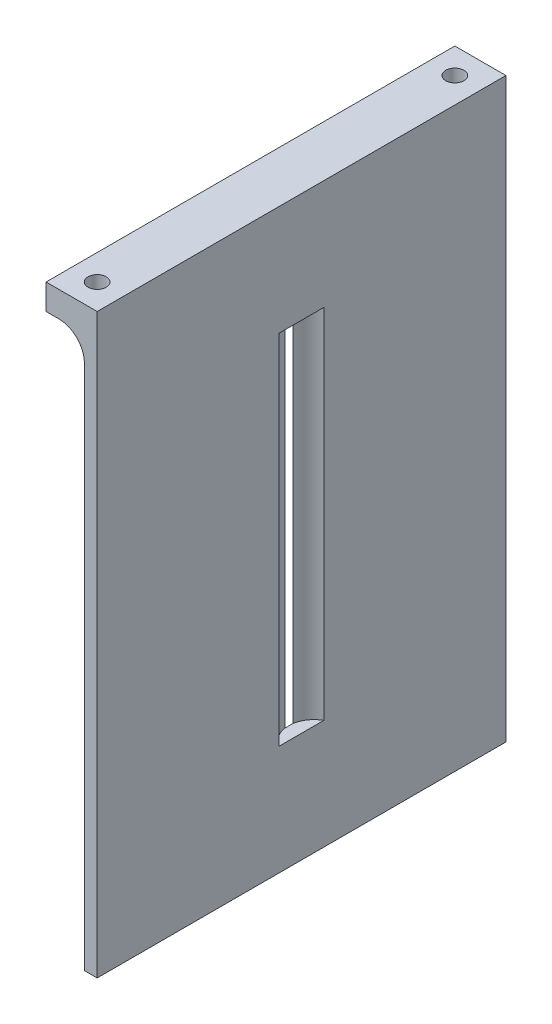
ISO-10303-21;
HEADER;
FILE_DESCRIPTION(('STEP AP214'),'2;1');
FILE_NAME('part.step','',(''),(''),'','','');
FILE_SCHEMA(('AUTOMOTIVE_DESIGN { 1 0 10303 214 1 1 1 1 }'));
ENDSEC;
DATA;
#1=APPLICATION_CONTEXT('core data for automotive mechanical design processes');
#2=APPLICATION_PROTOCOL_DEFINITION('international standard','automotive_design',2000,#1);
#3=PRODUCT_CONTEXT('',#1,'mechanical');
#4=PRODUCT('Part','Part','',(#3));
#5=PRODUCT_RELATED_PRODUCT_CATEGORY('part','',(#4));
#6=PRODUCT_DEFINITION_FORMATION('','',#4);
#7=PRODUCT_DEFINITION_CONTEXT('part definition',#1,'design');
#8=PRODUCT_DEFINITION('design','',#6,#7);
#9=PRODUCT_DEFINITION_SHAPE('','',#8);
#10=(LENGTH_UNIT() NAMED_UNIT(*) SI_UNIT(.MILLI.,.METRE.));
#11=(NAMED_UNIT(*) PLANE_ANGLE_UNIT() SI_UNIT($,.RADIAN.));
#12=(NAMED_UNIT(*) SI_UNIT($,.STERADIAN.) SOLID_ANGLE_UNIT());
#13=UNCERTAINTY_MEASURE_WITH_UNIT(LENGTH_MEASURE(1.E-05),#10,'distance_accuracy_value','');
#14=(GEOMETRIC_REPRESENTATION_CONTEXT(3) GLOBAL_UNCERTAINTY_ASSIGNED_CONTEXT((#13)) GLOBAL_UNIT_ASSIGNED_CONTEXT((#10,
#11,#12)) REPRESENTATION_CONTEXT('',''));
#15=CARTESIAN_POINT('',(0.,0.,0.));
#16=DIRECTION('',(0.,0.,1.));
#17=DIRECTION('',(1.,0.,0.));
#18=AXIS2_PLACEMENT_3D('',#15,#16,#17);
#19=CARTESIAN_POINT('',(52.8754332999628,0.,0.));
#20=DIRECTION('',(-1.,0.,0.));
#21=DIRECTION('',(0.,0.,1.));
#22=AXIS2_PLACEMENT_3D('',#19,#20,#21);
#23=PLANE('',#22);
#24=DIRECTION('',(0.,0.,-1.));
#25=VECTOR('',#24,1.);
#26=CARTESIAN_POINT('',(52.8754332999628,35.86734,-25.4));
#27=LINE('',#26,#25);
#28=CARTESIAN_POINT('',(52.8754332999628,35.86734,25.4));
#29=VERTEX_POINT('',#28);
#30=CARTESIAN_POINT('',(52.8754332999628,35.86734,-25.4));
#31=VERTEX_POINT('',#30);
#32=EDGE_CURVE('E191',#29,#31,#27,.T.);
#33=ORIENTED_EDGE('',*,*,#32,.F.);
#34=DIRECTION('',(0.,1.,0.));
#35=VECTOR('',#34,1.);
#36=CARTESIAN_POINT('',(52.8754332999628,35.86734,25.4));
#37=LINE('',#36,#35);
#38=CARTESIAN_POINT('',(52.8754332999628,-35.86734,25.4));
#39=VERTEX_POINT('',#38);
#40=EDGE_CURVE('E200',#39,#29,#37,.T.);
#41=ORIENTED_EDGE('',*,*,#40,.F.);
#42=DIRECTION('',(0.,0.,1.));
#43=VECTOR('',#42,1.);
#44=CARTESIAN_POINT('',(52.8754332999628,-35.86734,-25.4));
#45=LINE('',#44,#43);
#46=CARTESIAN_POINT('',(52.8754332999628,-35.86734,-25.4));
#47=VERTEX_POINT('',#46);
#48=EDGE_CURVE('E198',#47,#39,#45,.T.);
#49=ORIENTED_EDGE('',*,*,#48,.F.);
#50=DIRECTION('',(0.,-1.,0.));
#51=VECTOR('',#50,1.);
#52=CARTESIAN_POINT('',(52.8754332999628,35.86734,-25.4));
#53=LINE('',#52,#51);
#54=EDGE_CURVE('E185',#31,#47,#53,.T.);
#55=ORIENTED_EDGE('',*,*,#54,.F.);
#56=EDGE_LOOP('',(#33,#41,#49,#55));
#57=FACE_BOUND('',#56,.T.);
#58=DIRECTION('',(0.,1.,0.));
#59=VECTOR('',#58,1.);
#60=CARTESIAN_POINT('',(52.8754332999628,-31.2052561210692,2.77170963560014));
#61=LINE('',#60,#59);
#62=CARTESIAN_POINT('',(52.8754332999628,22.225,2.77170963560014));
#63=VERTEX_POINT('',#62);
#64=CARTESIAN_POINT('',(52.8754332999628,-22.225,2.77170963560014));
#65=VERTEX_POINT('',#64);
#66=EDGE_CURVE('E153',#63,#65,#61,.F.);
#67=ORIENTED_EDGE('',*,*,#66,.F.);
#68=DIRECTION('',(0.,0.,-1.));
#69=VECTOR('',#68,1.);
#70=CARTESIAN_POINT('',(52.8754332999628,22.225,-0.495299999999999));
#71=LINE('',#70,#69);
#72=CARTESIAN_POINT('',(52.8754332999628,22.225,-2.77170963560013));
#73=VERTEX_POINT('',#72);
#74=EDGE_CURVE('E141',#63,#73,#71,.T.);
#75=ORIENTED_EDGE('',*,*,#74,.T.);
#76=DIRECTION('',(0.,1.,0.));
#77=VECTOR('',#76,1.);
#78=CARTESIAN_POINT('',(52.8754332999628,-31.2052561210692,-2.77170963560013));
#79=LINE('',#78,#77);
#80=CARTESIAN_POINT('',(52.8754332999628,-22.225,-2.77170963560013));
#81=VERTEX_POINT('',#80);
#82=EDGE_CURVE('E147',#81,#73,#79,.T.);
#83=ORIENTED_EDGE('',*,*,#82,.F.);
#84=DIRECTION('',(0.,0.,1.));
#85=VECTOR('',#84,1.);
#86=CARTESIAN_POINT('',(52.8754332999628,-22.225,-0.495299999999999));
#87=LINE('',#86,#85);
#88=EDGE_CURVE('E130',#81,#65,#87,.T.);
#89=ORIENTED_EDGE('',*,*,#88,.T.);
#90=EDGE_LOOP('',(#67,#75,#83,#89));
#91=FACE_BOUND('',#90,.T.);
#92=ADVANCED_FACE('F41',(#57,#91),#23,.F.);
#93=CARTESIAN_POINT('',(51.2879332999628,0.,0.));
#94=DIRECTION('',(-1.,0.,0.));
#95=DIRECTION('',(0.,0.,1.));
#96=AXIS2_PLACEMENT_3D('',#93,#94,#95);
#97=PLANE('',#96);
#98=DIRECTION('',(0.,0.,1.));
#99=VECTOR('',#98,1.);
#100=CARTESIAN_POINT('',(51.2879332999628,-22.225,-0.495299999999999));
#101=LINE('',#100,#99);
#102=CARTESIAN_POINT('',(51.2879332999628,-22.225,-0.495299999999999));
#103=VERTEX_POINT('',#102);
#104=CARTESIAN_POINT('',(51.2879332999628,-22.225,0.495300000000001));
#105=VERTEX_POINT('',#104);
#106=EDGE_CURVE('E179',#103,#105,#101,.T.);
#107=ORIENTED_EDGE('',*,*,#106,.F.);
#108=DIRECTION('',(0.,-1.,0.));
#109=VECTOR('',#108,1.);
#110=CARTESIAN_POINT('',(51.2879332999628,22.225,-0.495299999999999));
#111=LINE('',#110,#109);
#112=CARTESIAN_POINT('',(51.2879332999628,22.225,-0.495299999999997));
#113=VERTEX_POINT('',#112);
#114=EDGE_CURVE('E150',#113,#103,#111,.T.);
#115=ORIENTED_EDGE('',*,*,#114,.F.);
#116=DIRECTION('',(0.,0.,-1.));
#117=VECTOR('',#116,1.);
#118=CARTESIAN_POINT('',(51.2879332999628,22.225,-0.495299999999999));
#119=LINE('',#118,#117);
#120=CARTESIAN_POINT('',(51.2879332999628,22.225,0.495300000000028));
#121=VERTEX_POINT('',#120);
#122=EDGE_CURVE('E183',#121,#113,#119,.T.);
#123=ORIENTED_EDGE('',*,*,#122,.F.);
#124=DIRECTION('',(0.,1.,0.));
#125=VECTOR('',#124,1.);
#126=CARTESIAN_POINT('',(51.2879332999628,22.225,0.495300000000001));
#127=LINE('',#126,#125);
#128=EDGE_CURVE('E181',#105,#121,#127,.T.);
#129=ORIENTED_EDGE('',*,*,#128,.F.);
#130=EDGE_LOOP('',(#107,#115,#123,#129));
#131=FACE_BOUND('',#130,.T.);
#132=DIRECTION('',(0.,1.,0.));
#133=VECTOR('',#132,1.);
#134=CARTESIAN_POINT('',(51.2879332999628,35.86734,25.4));
#135=LINE('',#134,#133);
#136=CARTESIAN_POINT('',(51.2879332999628,-35.86734,25.4));
#137=VERTEX_POINT('',#136);
#138=CARTESIAN_POINT('',(51.2879332999628,29.51734,25.4));
#139=VERTEX_POINT('',#138);
#140=EDGE_CURVE('E193',#137,#139,#135,.T.);
#141=ORIENTED_EDGE('',*,*,#140,.T.);
#142=DIRECTION('',(0.,0.,-1.));
#143=VECTOR('',#142,1.);
#144=CARTESIAN_POINT('',(51.2879332999628,29.51734,0.));
#145=LINE('',#144,#143);
#146=CARTESIAN_POINT('',(51.2879332999628,29.51734,-25.4));
#147=VERTEX_POINT('',#146);
#148=EDGE_CURVE('E214',#139,#147,#145,.T.);
#149=ORIENTED_EDGE('',*,*,#148,.T.);
#150=DIRECTION('',(0.,-1.,0.));
#151=VECTOR('',#150,1.);
#152=CARTESIAN_POINT('',(51.2879332999628,35.86734,-25.4));
#153=LINE('',#152,#151);
#154=CARTESIAN_POINT('',(51.2879332999628,-35.86734,-25.4));
#155=VERTEX_POINT('',#154);
#156=EDGE_CURVE('E188',#147,#155,#153,.T.);
#157=ORIENTED_EDGE('',*,*,#156,.T.);
#158=DIRECTION('',(0.,0.,1.));
#159=VECTOR('',#158,1.);
#160=CARTESIAN_POINT('',(51.2879332999628,-35.86734,-25.4));
#161=LINE('',#160,#159);
#162=EDGE_CURVE('E190',#155,#137,#161,.T.);
#163=ORIENTED_EDGE('',*,*,#162,.T.);
#164=EDGE_LOOP('',(#141,#149,#157,#163));
#165=FACE_BOUND('',#164,.T.);
#166=ADVANCED_FACE('F245',(#131,#165),#97,.T.);
#167=CARTESIAN_POINT('',(51.2879332999628,35.86734,-25.4));
#168=DIRECTION('',(0.,0.,1.));
#169=DIRECTION('',(1.,0.,0.));
#170=AXIS2_PLACEMENT_3D('',#167,#168,#169);
#171=PLANE('',#170);
#172=ORIENTED_EDGE('',*,*,#54,.T.);
#173=DIRECTION('',(1.,0.,0.));
#174=VECTOR('',#173,1.);
#175=CARTESIAN_POINT('',(51.2879332999628,-35.86734,-25.4));
#176=LINE('',#175,#174);
#177=EDGE_CURVE('E211',#155,#47,#176,.T.);
#178=ORIENTED_EDGE('',*,*,#177,.F.);
#179=ORIENTED_EDGE('',*,*,#156,.F.);
#180=CARTESIAN_POINT('',(48.1129332999628,29.51734,-25.4));
#181=DIRECTION('',(0.,0.,1.));
#182=DIRECTION('',(1.,0.,0.));
#183=AXIS2_PLACEMENT_3D('',#180,#181,#182);
#184=CIRCLE('',#183,3.175);
#185=CARTESIAN_POINT('',(48.1129332999628,32.69234,-25.4));
#186=VERTEX_POINT('',#185);
#187=EDGE_CURVE('E55',#147,#186,#184,.T.);
#188=ORIENTED_EDGE('',*,*,#187,.T.);
#189=DIRECTION('',(1.,0.,0.));
#190=VECTOR('',#189,1.);
#191=CARTESIAN_POINT('',(46.5254332999628,32.69234,-25.4));
#192=LINE('',#191,#190);
#193=CARTESIAN_POINT('',(46.5254332999628,32.69234,-25.4));
#194=VERTEX_POINT('',#193);
#195=EDGE_CURVE('E142',#194,#186,#192,.T.);
#196=ORIENTED_EDGE('',*,*,#195,.F.);
#197=DIRECTION('',(0.,-1.,0.));
#198=VECTOR('',#197,1.);
#199=CARTESIAN_POINT('',(46.5254332999628,35.86734,-25.4));
#200=LINE('',#199,#198);
#201=CARTESIAN_POINT('',(46.5254332999628,35.86734,-25.4));
#202=VERTEX_POINT('',#201);
#203=EDGE_CURVE('E168',#202,#194,#200,.T.);
#204=ORIENTED_EDGE('',*,*,#203,.F.);
#205=DIRECTION('',(1.,0.,0.));
#206=VECTOR('',#205,1.);
#207=CARTESIAN_POINT('',(51.2879332999628,35.86734,-25.4));
#208=LINE('',#207,#206);
#209=EDGE_CURVE('E196',#202,#31,#208,.T.);
#210=ORIENTED_EDGE('',*,*,#209,.T.);
#211=EDGE_LOOP('',(#172,#178,#179,#188,#196,#204,#210));
#212=FACE_BOUND('',#211,.T.);
#213=ADVANCED_FACE('F248',(#212),#171,.F.);
#214=CARTESIAN_POINT('',(51.2879332999628,-35.86734,-25.4));
#215=DIRECTION('',(0.,1.,0.));
#216=DIRECTION('',(0.,0.,1.));
#217=AXIS2_PLACEMENT_3D('',#214,#215,#216);
#218=PLANE('',#217);
#219=ORIENTED_EDGE('',*,*,#48,.T.);
#220=DIRECTION('',(1.,0.,0.));
#221=VECTOR('',#220,1.);
#222=CARTESIAN_POINT('',(51.2879332999628,-35.86734,25.4));
#223=LINE('',#222,#221);
#224=EDGE_CURVE('E208',#137,#39,#223,.T.);
#225=ORIENTED_EDGE('',*,*,#224,.F.);
#226=ORIENTED_EDGE('',*,*,#162,.F.);
#227=ORIENTED_EDGE('',*,*,#177,.T.);
#228=EDGE_LOOP('',(#219,#225,#226,#227));
#229=FACE_BOUND('',#228,.T.);
#230=ADVANCED_FACE('F259',(#229),#218,.F.);
#231=CARTESIAN_POINT('',(51.2879332999628,35.86734,25.4));
#232=DIRECTION('',(0.,0.,-1.));
#233=DIRECTION('',(-1.,0.,0.));
#234=AXIS2_PLACEMENT_3D('',#231,#232,#233);
#235=PLANE('',#234);
#236=DIRECTION('',(1.,0.,0.));
#237=VECTOR('',#236,1.);
#238=CARTESIAN_POINT('',(51.2879332999628,35.86734,25.4));
#239=LINE('',#238,#237);
#240=CARTESIAN_POINT('',(46.5254332999628,35.86734,25.4));
#241=VERTEX_POINT('',#240);
#242=EDGE_CURVE('E205',#241,#29,#239,.T.);
#243=ORIENTED_EDGE('',*,*,#242,.F.);
#244=DIRECTION('',(0.,1.,0.));
#245=VECTOR('',#244,1.);
#246=CARTESIAN_POINT('',(46.5254332999628,35.86734,25.4));
#247=LINE('',#246,#245);
#248=CARTESIAN_POINT('',(46.5254332999628,32.69234,25.4));
#249=VERTEX_POINT('',#248);
#250=EDGE_CURVE('E172',#249,#241,#247,.T.);
#251=ORIENTED_EDGE('',*,*,#250,.F.);
#252=DIRECTION('',(1.,0.,0.));
#253=VECTOR('',#252,1.);
#254=CARTESIAN_POINT('',(46.5254332999628,32.69234,25.4));
#255=LINE('',#254,#253);
#256=CARTESIAN_POINT('',(48.1129332999628,32.69234,25.4));
#257=VERTEX_POINT('',#256);
#258=EDGE_CURVE('E175',#249,#257,#255,.T.);
#259=ORIENTED_EDGE('',*,*,#258,.T.);
#260=CARTESIAN_POINT('',(48.1129332999628,29.51734,25.4));
#261=DIRECTION('',(0.,0.,-1.));
#262=DIRECTION('',(-1.,0.,0.));
#263=AXIS2_PLACEMENT_3D('',#260,#261,#262);
#264=CIRCLE('',#263,3.175);
#265=EDGE_CURVE('E11',#257,#139,#264,.T.);
#266=ORIENTED_EDGE('',*,*,#265,.T.);
#267=ORIENTED_EDGE('',*,*,#140,.F.);
#268=ORIENTED_EDGE('',*,*,#224,.T.);
#269=ORIENTED_EDGE('',*,*,#40,.T.);
#270=EDGE_LOOP('',(#243,#251,#259,#266,#267,#268,#269));
#271=FACE_BOUND('',#270,.T.);
#272=ADVANCED_FACE('F255',(#271),#235,.F.);
#273=CARTESIAN_POINT('',(51.2879332999628,35.86734,-25.4));
#274=DIRECTION('',(0.,-1.,0.));
#275=DIRECTION('',(0.,0.,-1.));
#276=AXIS2_PLACEMENT_3D('',#273,#274,#275);
#277=PLANE('',#276);
#278=CARTESIAN_POINT('',(49.7004332999628,35.86734,22.225));
#279=DIRECTION('',(0.,1.,0.));
#280=DIRECTION('',(0.,0.,1.));
#281=AXIS2_PLACEMENT_3D('',#278,#279,#280);
#282=CIRCLE('',#281,1.13029999999999);
#283=CARTESIAN_POINT('',(49.7004332999628,35.86734,23.3553));
#284=VERTEX_POINT('',#283);
#285=EDGE_CURVE('E155',#284,#284,#282,.T.);
#286=ORIENTED_EDGE('',*,*,#285,.F.);
#287=EDGE_LOOP('',(#286));
#288=FACE_BOUND('',#287,.T.);
#289=CARTESIAN_POINT('',(49.7004332999628,35.86734,-22.225));
#290=DIRECTION('',(0.,1.,0.));
#291=DIRECTION('',(0.,0.,1.));
#292=AXIS2_PLACEMENT_3D('',#289,#290,#291);
#293=CIRCLE('',#292,1.13029999999999);
#294=CARTESIAN_POINT('',(49.7004332999628,35.86734,-21.0947));
#295=VERTEX_POINT('',#294);
#296=EDGE_CURVE('E161',#295,#295,#293,.T.);
#297=ORIENTED_EDGE('',*,*,#296,.F.);
#298=EDGE_LOOP('',(#297));
#299=FACE_BOUND('',#298,.T.);
#300=ORIENTED_EDGE('',*,*,#32,.T.);
#301=ORIENTED_EDGE('',*,*,#209,.F.);
#302=DIRECTION('',(0.,0.,-1.));
#303=VECTOR('',#302,1.);
#304=CARTESIAN_POINT('',(46.5254332999628,35.86734,-25.4));
#305=LINE('',#304,#303);
#306=EDGE_CURVE('E165',#241,#202,#305,.T.);
#307=ORIENTED_EDGE('',*,*,#306,.F.);
#308=ORIENTED_EDGE('',*,*,#242,.T.);
#309=EDGE_LOOP('',(#300,#301,#307,#308));
#310=FACE_BOUND('',#309,.T.);
#311=ADVANCED_FACE('F244',(#288,#299,#310),#277,.F.);
#312=CARTESIAN_POINT('',(51.2879332999628,-22.225,-0.495299999999999));
#313=DIRECTION('',(0.,1.,0.));
#314=DIRECTION('',(0.,0.,1.));
#315=AXIS2_PLACEMENT_3D('',#312,#313,#314);
#316=PLANE('',#315);
#317=ORIENTED_EDGE('',*,*,#88,.F.);
#318=CARTESIAN_POINT('',(54.4240619500663,-22.225,0.));
#319=DIRECTION('',(0.,1.,0.));
#320=DIRECTION('',(0.,0.,1.));
#321=AXIS2_PLACEMENT_3D('',#318,#319,#320);
#322=CIRCLE('',#321,3.17500000000001);
#323=EDGE_CURVE('E134',#81,#103,#322,.T.);
#324=ORIENTED_EDGE('',*,*,#323,.T.);
#325=ORIENTED_EDGE('',*,*,#106,.T.);
#326=EDGE_CURVE('E136',#105,#65,#322,.T.);
#327=ORIENTED_EDGE('',*,*,#326,.T.);
#328=EDGE_LOOP('',(#317,#324,#325,#327));
#329=FACE_BOUND('',#328,.T.);
#330=ADVANCED_FACE('F132',(#329),#316,.T.);
#331=CARTESIAN_POINT('',(51.2879332999628,22.225,-0.495299999999999));
#332=DIRECTION('',(0.,-1.,0.));
#333=DIRECTION('',(0.,0.,-1.));
#334=AXIS2_PLACEMENT_3D('',#331,#332,#333);
#335=PLANE('',#334);
#336=ORIENTED_EDGE('',*,*,#74,.F.);
#337=CARTESIAN_POINT('',(54.4240619500663,22.225,0.));
#338=DIRECTION('',(0.,-1.,0.));
#339=DIRECTION('',(0.,0.,-1.));
#340=AXIS2_PLACEMENT_3D('',#337,#338,#339);
#341=CIRCLE('',#340,3.17500000000001);
#342=EDGE_CURVE('E308',#63,#121,#341,.T.);
#343=ORIENTED_EDGE('',*,*,#342,.T.);
#344=ORIENTED_EDGE('',*,*,#122,.T.);
#345=EDGE_CURVE('E311',#113,#73,#341,.T.);
#346=ORIENTED_EDGE('',*,*,#345,.T.);
#347=EDGE_LOOP('',(#336,#343,#344,#346));
#348=FACE_BOUND('',#347,.T.);
#349=ADVANCED_FACE('F238',(#348),#335,.T.);
#350=CARTESIAN_POINT('',(46.5254332999628,32.69234,-25.4));
#351=DIRECTION('',(0.,1.,0.));
#352=DIRECTION('',(0.,0.,1.));
#353=AXIS2_PLACEMENT_3D('',#350,#351,#352);
#354=PLANE('',#353);
#355=ORIENTED_EDGE('',*,*,#195,.T.);
#356=DIRECTION('',(0.,0.,-1.));
#357=VECTOR('',#356,1.);
#358=CARTESIAN_POINT('',(48.1129332999628,32.69234,-25.4));
#359=LINE('',#358,#357);
#360=EDGE_CURVE('E69',#186,#257,#359,.F.);
#361=ORIENTED_EDGE('',*,*,#360,.T.);
#362=ORIENTED_EDGE('',*,*,#258,.F.);
#363=DIRECTION('',(0.,0.,1.));
#364=VECTOR('',#363,1.);
#365=CARTESIAN_POINT('',(46.5254332999628,32.69234,-25.4));
#366=LINE('',#365,#364);
#367=EDGE_CURVE('E170',#194,#249,#366,.T.);
#368=ORIENTED_EDGE('',*,*,#367,.F.);
#369=EDGE_LOOP('',(#355,#361,#362,#368));
#370=FACE_BOUND('',#369,.T.);
#371=ADVANCED_FACE('F234',(#370),#354,.F.);
#372=CARTESIAN_POINT('',(46.5254332999628,0.,0.));
#373=DIRECTION('',(1.,0.,0.));
#374=DIRECTION('',(0.,0.,-1.));
#375=AXIS2_PLACEMENT_3D('',#372,#373,#374);
#376=PLANE('',#375);
#377=ORIENTED_EDGE('',*,*,#306,.T.);
#378=ORIENTED_EDGE('',*,*,#203,.T.);
#379=ORIENTED_EDGE('',*,*,#367,.T.);
#380=ORIENTED_EDGE('',*,*,#250,.T.);
#381=EDGE_LOOP('',(#377,#378,#379,#380));
#382=FACE_BOUND('',#381,.T.);
#383=ADVANCED_FACE('F231',(#382),#376,.F.);
#384=CARTESIAN_POINT('',(48.1129332999628,29.51734,0.));
#385=DIRECTION('',(0.,0.,-1.));
#386=DIRECTION('',(-1.,0.,0.));
#387=AXIS2_PLACEMENT_3D('',#384,#385,#386);
#388=CYLINDRICAL_SURFACE('',#387,3.175);
#389=CARTESIAN_POINT('',(49.7004332999628,32.2669706570156,23.3553));
#390=CARTESIAN_POINT('',(49.783871032019,32.2187883248277,23.3552961049754));
#391=CARTESIAN_POINT('',(49.8651766717591,32.1667222779059,23.346034188989));
#392=CARTESIAN_POINT('',(50.0206165893448,32.0571230977672,23.3119419793759));
#393=CARTESIAN_POINT('',(50.0947264582223,31.9995725845505,23.2870606965942));
#394=CARTESIAN_POINT('',(50.2268401818135,31.887718668519,23.2275679905478));
#395=CARTESIAN_POINT('',(50.2857188882912,31.8337264342299,23.1942820824601));
#396=CARTESIAN_POINT('',(50.396176629388,31.7249237584092,23.1183175181832));
#397=CARTESIAN_POINT('',(50.4477572940766,31.6701135026217,23.0756409649199));
#398=CARTESIAN_POINT('',(50.5401778275962,31.5651883798487,22.9841862494722));
#399=CARTESIAN_POINT('',(50.5814943589207,31.514997807036,22.9359748661512));
#400=CARTESIAN_POINT('',(50.6567736903065,31.4181859944428,22.8309413266865));
#401=CARTESIAN_POINT('',(50.6907521753909,31.3715572820017,22.7741379870408));
#402=CARTESIAN_POINT('',(50.7366248339886,31.3055527006528,22.6781172290072));
#403=CARTESIAN_POINT('',(50.7516078157388,31.2833006255561,22.6423633433386));
#404=CARTESIAN_POINT('',(50.7783124729097,31.2427278943404,22.5675332018815));
#405=CARTESIAN_POINT('',(50.7900388750176,31.2244015492458,22.5284618698964));
#406=CARTESIAN_POINT('',(50.807651756972,31.196429167238,22.4547730355617));
#407=CARTESIAN_POINT('',(50.8142220426403,31.1857985106896,22.4207017223581));
#408=CARTESIAN_POINT('',(50.8242428580825,31.1694657214762,22.350959929679));
#409=CARTESIAN_POINT('',(50.827698138763,31.1637560840161,22.3152919728721));
#410=CARTESIAN_POINT('',(50.8311681395862,31.1580221072665,22.2431046539727));
#411=CARTESIAN_POINT('',(50.8311627927268,31.158030927368,22.2065815541636));
#412=CARTESIAN_POINT('',(50.8276620227582,31.1638157895556,22.1341615815542));
#413=CARTESIAN_POINT('',(50.8241636721015,31.1695966693057,22.0982652597451));
#414=CARTESIAN_POINT('',(50.8131235206582,31.1875867498441,22.0219237503692));
#415=CARTESIAN_POINT('',(50.8049754195433,31.2007529815171,21.9817986189672));
#416=CARTESIAN_POINT('',(50.7850891728305,31.2321441829843,21.9045307813077));
#417=CARTESIAN_POINT('',(50.7733426386593,31.2503809638352,21.8673953026323));
#418=CARTESIAN_POINT('',(50.7388340150093,31.3024841511626,21.7743788854264));
#419=CARTESIAN_POINT('',(50.7137290923513,31.3390872178103,21.7209273853518));
#420=CARTESIAN_POINT('',(50.6575104558255,31.4168341530538,21.6209467945313));
#421=CARTESIAN_POINT('',(50.6263805836865,31.4579901018974,21.5744369283116));
#422=CARTESIAN_POINT('',(50.5674730693559,31.5316603317878,21.4987147070924));
#423=CARTESIAN_POINT('',(50.5408644556936,31.5637024400672,21.468115599647));
#424=CARTESIAN_POINT('',(50.4848701536369,31.6283525848123,21.4102240318128));
#425=CARTESIAN_POINT('',(50.4554832803791,31.6609608578503,21.3829329936652));
#426=CARTESIAN_POINT('',(50.3632714620657,31.7589054543876,21.3059546646744));
#427=CARTESIAN_POINT('',(50.2963831813955,31.8243771201152,21.2611467383326));
#428=CARTESIAN_POINT('',(50.1520734683996,31.9529006923365,21.1856389213071));
#429=CARTESIAN_POINT('',(50.0745865860317,32.0159341682953,21.1550323381012));
#430=CARTESIAN_POINT('',(49.9107765811235,32.1362340936043,21.1112377342787));
#431=CARTESIAN_POINT('',(49.8244814790476,32.1935177477247,21.097996225766));
#432=CARTESIAN_POINT('',(49.6752237682283,32.2822636503846,21.0933797766598));
#433=CARTESIAN_POINT('',(49.6138084815759,32.3160618768474,21.0962905880626));
#434=CARTESIAN_POINT('',(49.489987364312,32.3790088589078,21.1127137984261));
#435=CARTESIAN_POINT('',(49.4275821942669,32.4081605826235,21.1262193966721));
#436=CARTESIAN_POINT('',(49.3036362940068,32.4613897753364,21.164640989334));
#437=CARTESIAN_POINT('',(49.242102432066,32.4854376715381,21.1896209643957));
#438=CARTESIAN_POINT('',(49.1229653046441,32.5280648311071,21.25104255683));
#439=CARTESIAN_POINT('',(49.0653608822994,32.5466457093998,21.2874807829087));
#440=CARTESIAN_POINT('',(48.9620321014484,32.5771252996041,21.3669902411691));
#441=CARTESIAN_POINT('',(48.9156984604209,32.5894930670611,21.4090940847856));
#442=CARTESIAN_POINT('',(48.8302805611169,32.6105545806027,21.5008866089641));
#443=CARTESIAN_POINT('',(48.7911951658177,32.6192489032097,21.5505740976568));
#444=CARTESIAN_POINT('',(48.7227458276359,32.6334183220982,21.6545052432404));
#445=CARTESIAN_POINT('',(48.6931283619068,32.6389810945766,21.7085704902904));
#446=CARTESIAN_POINT('',(48.6430283491583,32.6478789951003,21.8209484209027));
#447=CARTESIAN_POINT('',(48.6225459528961,32.6512140863823,21.8792611745437));
#448=CARTESIAN_POINT('',(48.5911781643908,32.6561557360393,21.9991440809584));
#449=CARTESIAN_POINT('',(48.58039664211,32.657743625876,22.060742177952));
#450=CARTESIAN_POINT('',(48.5691263032176,32.6594007759076,22.1848951322973));
#451=CARTESIAN_POINT('',(48.5686381526869,32.6594699378261,22.2474500513025));
#452=CARTESIAN_POINT('',(48.5780088204626,32.6580966202982,22.3722746722134));
#453=CARTESIAN_POINT('',(48.5879513010365,32.6566419183458,22.4345379822134));
#454=CARTESIAN_POINT('',(48.6180119068576,32.6519452090254,22.5564901683029));
#455=CARTESIAN_POINT('',(48.6381301132307,32.6487031874081,22.6161790238636));
#456=CARTESIAN_POINT('',(48.6878614154827,32.6399535599281,22.7311535871061));
#457=CARTESIAN_POINT('',(48.7174567578353,32.6344501848449,22.7864472883802));
#458=CARTESIAN_POINT('',(48.7851620167557,32.6205516633367,22.8911387795157));
#459=CARTESIAN_POINT('',(48.8232705295078,32.6121569935607,22.9405375393906));
#460=CARTESIAN_POINT('',(48.906160252578,32.5919472190845,23.0315055525367));
#461=CARTESIAN_POINT('',(48.9508597646425,32.5801725224266,23.0731582433195));
#462=CARTESIAN_POINT('',(49.0456008960722,32.5526626641184,23.1482695192729));
#463=CARTESIAN_POINT('',(49.0956425016203,32.5369275127115,23.1817281256363));
#464=CARTESIAN_POINT('',(49.1990545534886,32.5012881605804,23.2397437389898));
#465=CARTESIAN_POINT('',(49.2524154082581,32.4813956131557,23.2643251145302));
#466=CARTESIAN_POINT('',(49.3607142145964,32.4374559739687,23.3045856480633));
#467=CARTESIAN_POINT('',(49.4156514311056,32.413410793154,23.3202688866136));
#468=CARTESIAN_POINT('',(49.5092021205204,32.3691631721662,23.3397073345498));
#469=CARTESIAN_POINT('',(49.5478453928562,32.3499227362612,23.3456172734787));
#470=CARTESIAN_POINT('',(49.624615206345,32.3097091570947,23.3534143092146));
#471=CARTESIAN_POINT('',(49.6627417926106,32.2887361662541,23.3553017595079));
#472=CARTESIAN_POINT('',(49.7004332999628,32.2669706570156,23.3553));
#473=B_SPLINE_CURVE_WITH_KNOTS('',3,(#389,#390,#391,#392,#393,#394,#395,#396,#397,#398,#399,
#400,#401,#402,#403,#404,#405,#406,#407,#408,#409,#410,#411,#412,#413,#414,#415,#416,#417,#418,
#419,#420,#421,#422,#423,#424,#425,#426,#427,#428,#429,#430,#431,#432,#433,#434,#435,#436,#437,
#438,#439,#440,#441,#442,#443,#444,#445,#446,#447,#448,#449,#450,#451,#452,#453,#454,#455,#456,
#457,#458,#459,#460,#461,#462,#463,#464,#465,#466,#467,#468,#469,#470,#471,#472),.UNSPECIFIED.,
.T.,.F.,(4,2,2,2,2,2,2,2,2,2,2,2,2,2,2,2,2,2,2,2,2,2,2,2,2,2,2,2,2,2,2,2,2,2,2,2,2,2,2,2,2,4),
(0.,0.288841890763087,0.578631639626604,0.837423041878636,1.09615654967519,1.33829817809595,
1.57991699219024,1.71371715934828,1.84732209812617,1.95577577340019,2.06406375735839,
2.17297967209887,2.28198694786027,2.41029665297479,2.53890777631661,2.74619417112263,
2.954044388291,3.10889898708245,3.26381992827272,3.57358755437263,3.88536259919687,
4.19617504135315,4.40582691954847,4.61534433377325,4.82604446131961,5.03668228663836,
5.2271792467458,5.41764629852447,5.60247519349186,5.78730713860017,5.97409535998131,
6.16089566833328,6.34920580826521,6.53751744952193,6.72547837005717,6.91340831881832,
7.09917900552538,7.28494921175869,7.47020551984192,7.65537680323587,7.78586744358254,
7.91634661626634),.UNSPECIFIED.);
#474=CARTESIAN_POINT('',(49.7004332999628,32.2669706570156,23.3553));
#475=VERTEX_POINT('',#474);
#476=EDGE_CURVE('E46',#475,#475,#473,.T.);
#477=ORIENTED_EDGE('',*,*,#476,.T.);
#478=EDGE_LOOP('',(#477));
#479=FACE_BOUND('',#478,.T.);
#480=CARTESIAN_POINT('',(49.7004332999628,32.2669706570156,-21.0947));
#481=CARTESIAN_POINT('',(49.783871032019,32.2187883248277,-21.0947038950246));
#482=CARTESIAN_POINT('',(49.8651766717591,32.1667222779059,-21.103965811011));
#483=CARTESIAN_POINT('',(50.0206165893448,32.0571230977672,-21.1380580206241));
#484=CARTESIAN_POINT('',(50.0947264582223,31.9995725845505,-21.1629393034057));
#485=CARTESIAN_POINT('',(50.2268401818135,31.887718668519,-21.2224320094522));
#486=CARTESIAN_POINT('',(50.2857188882912,31.8337264342299,-21.2557179175399));
#487=CARTESIAN_POINT('',(50.396176629388,31.7249237584092,-21.3316824818168));
#488=CARTESIAN_POINT('',(50.4477572940766,31.6701135026217,-21.3743590350801));
#489=CARTESIAN_POINT('',(50.5401778275962,31.5651883798487,-21.4658137505278));
#490=CARTESIAN_POINT('',(50.5814943589207,31.514997807036,-21.5140251338488));
#491=CARTESIAN_POINT('',(50.6567736903065,31.4181859944428,-21.6190586733135));
#492=CARTESIAN_POINT('',(50.6907521753909,31.3715572820017,-21.6758620129592));
#493=CARTESIAN_POINT('',(50.7366248339886,31.3055527006528,-21.7718827709928));
#494=CARTESIAN_POINT('',(50.7516078157388,31.2833006255561,-21.8076366566614));
#495=CARTESIAN_POINT('',(50.7783124729097,31.2427278943404,-21.8824667981185));
#496=CARTESIAN_POINT('',(50.7900388750176,31.2244015492458,-21.9215381301036));
#497=CARTESIAN_POINT('',(50.807651756972,31.196429167238,-21.9952269644383));
#498=CARTESIAN_POINT('',(50.8142220426403,31.1857985106896,-22.0292982776419));
#499=CARTESIAN_POINT('',(50.8242428580825,31.1694657214762,-22.099040070321));
#500=CARTESIAN_POINT('',(50.827698138763,31.1637560840161,-22.1347080271279));
#501=CARTESIAN_POINT('',(50.8311681395862,31.1580221072665,-22.2068953460273));
#502=CARTESIAN_POINT('',(50.8311627927268,31.158030927368,-22.2434184458364));
#503=CARTESIAN_POINT('',(50.8276620227582,31.1638157895556,-22.3158384184458));
#504=CARTESIAN_POINT('',(50.8241636721015,31.1695966693057,-22.3517347402549));
#505=CARTESIAN_POINT('',(50.8131235206582,31.1875867498441,-22.4280762496308));
#506=CARTESIAN_POINT('',(50.8049754195433,31.2007529815171,-22.4682013810328));
#507=CARTESIAN_POINT('',(50.7850891728305,31.2321441829843,-22.5454692186923));
#508=CARTESIAN_POINT('',(50.7733426386593,31.2503809638352,-22.5826046973677));
#509=CARTESIAN_POINT('',(50.7388340150093,31.3024841511626,-22.6756211145736));
#510=CARTESIAN_POINT('',(50.7137290923513,31.3390872178103,-22.7290726146482));
#511=CARTESIAN_POINT('',(50.6575104558255,31.4168341530538,-22.8290532054687));
#512=CARTESIAN_POINT('',(50.6263805836865,31.4579901018974,-22.8755630716884));
#513=CARTESIAN_POINT('',(50.5674730693559,31.5316603317878,-22.9512852929076));
#514=CARTESIAN_POINT('',(50.5408644556936,31.5637024400672,-22.981884400353));
#515=CARTESIAN_POINT('',(50.4848701536369,31.6283525848123,-23.0397759681872));
#516=CARTESIAN_POINT('',(50.4554832803791,31.6609608578503,-23.0670670063348));
#517=CARTESIAN_POINT('',(50.3632714620657,31.7589054543876,-23.1440453353256));
#518=CARTESIAN_POINT('',(50.2963831813955,31.8243771201152,-23.1888532616674));
#519=CARTESIAN_POINT('',(50.1520734683996,31.9529006923365,-23.2643610786929));
#520=CARTESIAN_POINT('',(50.0745865860317,32.0159341682953,-23.2949676618988));
#521=CARTESIAN_POINT('',(49.9107765811235,32.1362340936043,-23.3387622657212));
#522=CARTESIAN_POINT('',(49.8244814790476,32.1935177477247,-23.352003774234));
#523=CARTESIAN_POINT('',(49.6752237682283,32.2822636503846,-23.3566202233402));
#524=CARTESIAN_POINT('',(49.6138084815759,32.3160618768474,-23.3537094119374));
#525=CARTESIAN_POINT('',(49.489987364312,32.3790088589078,-23.3372862015739));
#526=CARTESIAN_POINT('',(49.4275821942669,32.4081605826235,-23.3237806033279));
#527=CARTESIAN_POINT('',(49.3036362940068,32.4613897753364,-23.285359010666));
#528=CARTESIAN_POINT('',(49.242102432066,32.4854376715381,-23.2603790356043));
#529=CARTESIAN_POINT('',(49.1229653046441,32.5280648311071,-23.19895744317));
#530=CARTESIAN_POINT('',(49.0653608822994,32.5466457093998,-23.1625192170913));
#531=CARTESIAN_POINT('',(48.9620321014484,32.5771252996041,-23.0830097588309));
#532=CARTESIAN_POINT('',(48.9156984604209,32.5894930670611,-23.0409059152144));
#533=CARTESIAN_POINT('',(48.8302805611169,32.6105545806027,-22.9491133910359));
#534=CARTESIAN_POINT('',(48.7911951658177,32.6192489032097,-22.8994259023432));
#535=CARTESIAN_POINT('',(48.7227458276359,32.6334183220982,-22.7954947567596));
#536=CARTESIAN_POINT('',(48.6931283619068,32.6389810945766,-22.7414295097096));
#537=CARTESIAN_POINT('',(48.6430283491583,32.6478789951003,-22.6290515790973));
#538=CARTESIAN_POINT('',(48.6225459528961,32.6512140863823,-22.5707388254563));
#539=CARTESIAN_POINT('',(48.5911781643908,32.6561557360393,-22.4508559190416));
#540=CARTESIAN_POINT('',(48.58039664211,32.657743625876,-22.389257822048));
#541=CARTESIAN_POINT('',(48.5691263032176,32.6594007759076,-22.2651048677027));
#542=CARTESIAN_POINT('',(48.5686381526869,32.6594699378261,-22.2025499486975));
#543=CARTESIAN_POINT('',(48.5780088204626,32.6580966202982,-22.0777253277866));
#544=CARTESIAN_POINT('',(48.5879513010365,32.6566419183458,-22.0154620177866));
#545=CARTESIAN_POINT('',(48.6180119068576,32.6519452090254,-21.8935098316971));
#546=CARTESIAN_POINT('',(48.6381301132307,32.6487031874081,-21.8338209761364));
#547=CARTESIAN_POINT('',(48.6878614154827,32.6399535599281,-21.7188464128939));
#548=CARTESIAN_POINT('',(48.7174567578353,32.6344501848449,-21.6635527116198));
#549=CARTESIAN_POINT('',(48.7851620167557,32.6205516633367,-21.5588612204843));
#550=CARTESIAN_POINT('',(48.8232705295078,32.6121569935607,-21.5094624606093));
#551=CARTESIAN_POINT('',(48.906160252578,32.5919472190845,-21.4184944474633));
#552=CARTESIAN_POINT('',(48.9508597646425,32.5801725224266,-21.3768417566805));
#553=CARTESIAN_POINT('',(49.0456008960722,32.5526626641184,-21.3017304807271));
#554=CARTESIAN_POINT('',(49.0956425016203,32.5369275127115,-21.2682718743637));
#555=CARTESIAN_POINT('',(49.1990545534886,32.5012881605804,-21.2102562610102));
#556=CARTESIAN_POINT('',(49.2524154082581,32.4813956131557,-21.1856748854697));
#557=CARTESIAN_POINT('',(49.3607142145964,32.4374559739687,-21.1454143519367));
#558=CARTESIAN_POINT('',(49.4156514311056,32.413410793154,-21.1297311133864));
#559=CARTESIAN_POINT('',(49.5092021205204,32.3691631721662,-21.1102926654502));
#560=CARTESIAN_POINT('',(49.5478453928562,32.3499227362612,-21.1043827265213));
#561=CARTESIAN_POINT('',(49.624615206345,32.3097091570947,-21.0965856907853));
#562=CARTESIAN_POINT('',(49.6627417926106,32.2887361662541,-21.0946982404921));
#563=CARTESIAN_POINT('',(49.7004332999628,32.2669706570156,-21.0947));
#564=B_SPLINE_CURVE_WITH_KNOTS('',3,(#480,#481,#482,#483,#484,#485,#486,#487,#488,#489,#490,
#491,#492,#493,#494,#495,#496,#497,#498,#499,#500,#501,#502,#503,#504,#505,#506,#507,#508,#509,
#510,#511,#512,#513,#514,#515,#516,#517,#518,#519,#520,#521,#522,#523,#524,#525,#526,#527,#528,
#529,#530,#531,#532,#533,#534,#535,#536,#537,#538,#539,#540,#541,#542,#543,#544,#545,#546,#547,
#548,#549,#550,#551,#552,#553,#554,#555,#556,#557,#558,#559,#560,#561,#562,#563),.UNSPECIFIED.,
.T.,.F.,(4,2,2,2,2,2,2,2,2,2,2,2,2,2,2,2,2,2,2,2,2,2,2,2,2,2,2,2,2,2,2,2,2,2,2,2,2,2,2,2,2,4),
(0.,0.288841890763087,0.578631639626604,0.837423041878636,1.09615654967519,1.33829817809595,
1.57991699219024,1.71371715934828,1.84732209812617,1.95577577340018,2.06406375735839,
2.17297967209887,2.28198694786027,2.41029665297479,2.53890777631661,2.74619417112263,
2.954044388291,3.10889898708245,3.26381992827272,3.57358755437263,3.88536259919687,
4.19617504135315,4.40582691954847,4.61534433377325,4.82604446131961,5.03668228663836,
5.2271792467458,5.41764629852447,5.60247519349186,5.78730713860017,5.97409535998131,
6.16089566833328,6.34920580826521,6.53751744952193,6.72547837005717,6.91340831881832,
7.09917900552538,7.28494921175869,7.47020551984192,7.65537680323587,7.78586744358254,
7.91634661626634),.UNSPECIFIED.);
#565=CARTESIAN_POINT('',(49.7004332999628,32.2669706570156,-21.0947));
#566=VERTEX_POINT('',#565);
#567=EDGE_CURVE('E164',#566,#566,#564,.T.);
#568=ORIENTED_EDGE('',*,*,#567,.T.);
#569=EDGE_LOOP('',(#568));
#570=FACE_BOUND('',#569,.T.);
#571=ORIENTED_EDGE('',*,*,#265,.F.);
#572=ORIENTED_EDGE('',*,*,#360,.F.);
#573=ORIENTED_EDGE('',*,*,#187,.F.);
#574=ORIENTED_EDGE('',*,*,#148,.F.);
#575=EDGE_LOOP('',(#571,#572,#573,#574));
#576=FACE_BOUND('',#575,.T.);
#577=ADVANCED_FACE('F43',(#479,#570,#576),#388,.F.);
#578=CARTESIAN_POINT('',(49.7004332999628,35.86734,-22.225));
#579=DIRECTION('',(0.,1.,0.));
#580=DIRECTION('',(0.,0.,1.));
#581=AXIS2_PLACEMENT_3D('',#578,#579,#580);
#582=CYLINDRICAL_SURFACE('',#581,1.13029999999999);
#583=ORIENTED_EDGE('',*,*,#296,.T.);
#584=EDGE_LOOP('',(#583));
#585=FACE_BOUND('',#584,.T.);
#586=ORIENTED_EDGE('',*,*,#567,.F.);
#587=EDGE_LOOP('',(#586));
#588=FACE_BOUND('',#587,.T.);
#589=ADVANCED_FACE('F223',(#585,#588),#582,.F.);
#590=CARTESIAN_POINT('',(49.7004332999628,35.86734,22.225));
#591=DIRECTION('',(0.,1.,0.));
#592=DIRECTION('',(0.,0.,1.));
#593=AXIS2_PLACEMENT_3D('',#590,#591,#592);
#594=CYLINDRICAL_SURFACE('',#593,1.13029999999999);
#595=ORIENTED_EDGE('',*,*,#285,.T.);
#596=EDGE_LOOP('',(#595));
#597=FACE_BOUND('',#596,.T.);
#598=ORIENTED_EDGE('',*,*,#476,.F.);
#599=EDGE_LOOP('',(#598));
#600=FACE_BOUND('',#599,.T.);
#601=ADVANCED_FACE('F227',(#597,#600),#594,.F.);
#602=CARTESIAN_POINT('',(54.4240619500663,-31.2052561210692,0.));
#603=DIRECTION('',(0.,1.,0.));
#604=DIRECTION('',(0.,0.,1.));
#605=AXIS2_PLACEMENT_3D('',#602,#603,#604);
#606=CYLINDRICAL_SURFACE('',#605,3.17500000000001);
#607=ORIENTED_EDGE('',*,*,#66,.T.);
#608=ORIENTED_EDGE('',*,*,#326,.F.);
#609=ORIENTED_EDGE('',*,*,#128,.T.);
#610=ORIENTED_EDGE('',*,*,#342,.F.);
#611=EDGE_LOOP('',(#607,#608,#609,#610));
#612=FACE_BOUND('',#611,.T.);
#613=ADVANCED_FACE('F294',(#612),#606,.F.);
#614=ORIENTED_EDGE('',*,*,#82,.T.);
#615=ORIENTED_EDGE('',*,*,#345,.F.);
#616=ORIENTED_EDGE('',*,*,#114,.T.);
#617=ORIENTED_EDGE('',*,*,#323,.F.);
#618=EDGE_LOOP('',(#614,#615,#616,#617));
#619=FACE_BOUND('',#618,.T.);
#620=ADVANCED_FACE('F146',(#619),#606,.F.);
#621=CLOSED_SHELL('',(#92,#166,#213,#230,#272,#311,#330,#349,#371,#383,#577,#589,#601,#613,#620));
#622=MANIFOLD_SOLID_BREP('B2',#621);
#623=ADVANCED_BREP_SHAPE_REPRESENTATION('',(#18,#622),#14);
#624=SHAPE_DEFINITION_REPRESENTATION(#9,#623);
ENDSEC;
END-ISO-10303-21;
